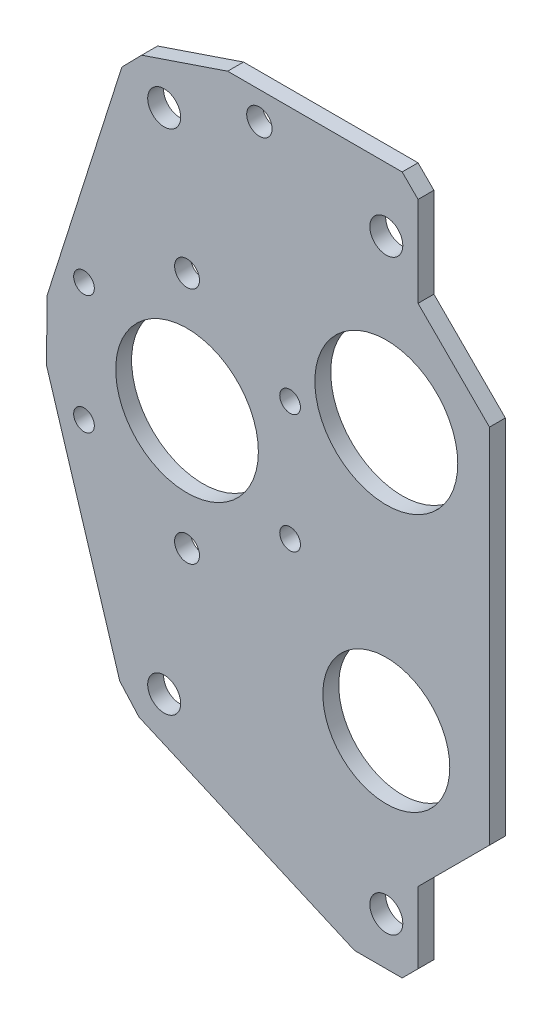
ISO-10303-21;
HEADER;
FILE_DESCRIPTION(('STEP AP214'),'2;1');
FILE_NAME('part.step','',(''),(''),'','','');
FILE_SCHEMA(('AUTOMOTIVE_DESIGN { 1 0 10303 214 1 1 1 1 }'));
ENDSEC;
DATA;
#1=APPLICATION_CONTEXT('core data for automotive mechanical design processes');
#2=APPLICATION_PROTOCOL_DEFINITION('international standard','automotive_design',2000,#1);
#3=PRODUCT_CONTEXT('',#1,'mechanical');
#4=PRODUCT('Part','Part','',(#3));
#5=PRODUCT_RELATED_PRODUCT_CATEGORY('part','',(#4));
#6=PRODUCT_DEFINITION_FORMATION('','',#4);
#7=PRODUCT_DEFINITION_CONTEXT('part definition',#1,'design');
#8=PRODUCT_DEFINITION('design','',#6,#7);
#9=PRODUCT_DEFINITION_SHAPE('','',#8);
#10=(LENGTH_UNIT() NAMED_UNIT(*) SI_UNIT(.MILLI.,.METRE.));
#11=(NAMED_UNIT(*) PLANE_ANGLE_UNIT() SI_UNIT($,.RADIAN.));
#12=(NAMED_UNIT(*) SI_UNIT($,.STERADIAN.) SOLID_ANGLE_UNIT());
#13=UNCERTAINTY_MEASURE_WITH_UNIT(LENGTH_MEASURE(1.E-05),#10,'distance_accuracy_value','');
#14=(GEOMETRIC_REPRESENTATION_CONTEXT(3) GLOBAL_UNCERTAINTY_ASSIGNED_CONTEXT((#13)) GLOBAL_UNIT_ASSIGNED_CONTEXT((#10,
#11,#12)) REPRESENTATION_CONTEXT('',''));
#15=CARTESIAN_POINT('',(0.,0.,0.));
#16=DIRECTION('',(0.,0.,1.));
#17=DIRECTION('',(1.,0.,0.));
#18=AXIS2_PLACEMENT_3D('',#15,#16,#17);
#19=CARTESIAN_POINT('',(0.,0.,0.));
#20=DIRECTION('',(0.,0.,1.));
#21=DIRECTION('',(1.,0.,0.));
#22=AXIS2_PLACEMENT_3D('',#19,#20,#21);
#23=PLANE('',#22);
#24=DIRECTION('',(-0.947188076798087,-0.32067857298476,0.));
#25=VECTOR('',#24,1.);
#26=CARTESIAN_POINT('',(-33.1609002039906,97.9473277455423,0.));
#27=LINE('',#26,#25);
#28=CARTESIAN_POINT('',(-48.9538078594664,92.6005046443076,0.));
#29=VERTEX_POINT('',#28);
#30=CARTESIAN_POINT('',(-31.75,98.425,0.));
#31=VERTEX_POINT('',#30);
#32=EDGE_CURVE('E661',#29,#31,#27,.F.);
#33=ORIENTED_EDGE('',*,*,#32,.F.);
#34=DIRECTION('',(0.7004757379388,0.713676215492077,0.));
#35=VECTOR('',#34,1.);
#36=CARTESIAN_POINT('',(-48.9538078594664,92.6005046443076,0.));
#37=LINE('',#36,#35);
#38=CARTESIAN_POINT('',(-52.9229679271194,88.5565456856429,0.));
#39=VERTEX_POINT('',#38);
#40=EDGE_CURVE('E653',#29,#39,#37,.F.);
#41=ORIENTED_EDGE('',*,*,#40,.T.);
#42=DIRECTION('',(-0.302941078368201,-0.953009288011985,0.));
#43=VECTOR('',#42,1.);
#44=CARTESIAN_POINT('',(-73.6328287693253,23.4062866241446,0.));
#45=LINE('',#44,#43);
#46=CARTESIAN_POINT('',(-67.9263241523619,41.3581336676134,0.));
#47=VERTEX_POINT('',#46);
#48=EDGE_CURVE('E651',#47,#39,#45,.F.);
#49=ORIENTED_EDGE('',*,*,#48,.F.);
#50=DIRECTION('',(0.00396394921512312,0.999992143522448,0.));
#51=VECTOR('',#50,1.);
#52=CARTESIAN_POINT('',(-67.9263241523619,41.3581336676133,0.));
#53=LINE('',#52,#51);
#54=CARTESIAN_POINT('',(-67.9743607697863,29.2398552995184,0.));
#55=VERTEX_POINT('',#54);
#56=EDGE_CURVE('E644',#47,#55,#53,.F.);
#57=ORIENTED_EDGE('',*,*,#56,.T.);
#58=DIRECTION('',(0.295376256726555,-0.955381006176179,0.));
#59=VECTOR('',#58,1.);
#60=CARTESIAN_POINT('',(-53.7923971636767,-16.6310579882147,0.));
#61=LINE('',#60,#59);
#62=CARTESIAN_POINT('',(-53.3456573135953,-18.0760176210564,0.));
#63=VERTEX_POINT('',#62);
#64=EDGE_CURVE('E145',#63,#55,#61,.F.);
#65=ORIENTED_EDGE('',*,*,#64,.F.);
#66=DIRECTION('',(-0.666107578502949,0.745855678976126,0.));
#67=VECTOR('',#66,1.);
#68=CARTESIAN_POINT('',(-53.3456573135953,-18.0760176210564,0.));
#69=LINE('',#68,#67);
#70=CARTESIAN_POINT('',(-49.4993940732019,-22.3827653195768,0.));
#71=VERTEX_POINT('',#70);
#72=EDGE_CURVE('E140',#63,#71,#69,.F.);
#73=ORIENTED_EDGE('',*,*,#72,.T.);
#74=DIRECTION('',(0.916045236310745,-0.401074961861734,0.));
#75=VECTOR('',#74,1.);
#76=CARTESIAN_POINT('',(-16.1860190531105,-36.9684648964657,0.));
#77=LINE('',#76,#75);
#78=CARTESIAN_POINT('',(-6.34999999999987,-41.275,0.));
#79=VERTEX_POINT('',#78);
#80=EDGE_CURVE('E131',#79,#71,#77,.F.);
#81=ORIENTED_EDGE('',*,*,#80,.F.);
#82=DIRECTION('',(1.,0.,0.));
#83=VECTOR('',#82,1.);
#84=CARTESIAN_POINT('',(-76.2,-41.275,0.));
#85=LINE('',#84,#83);
#86=CARTESIAN_POINT('',(3.17499999999999,-41.275,0.));
#87=VERTEX_POINT('',#86);
#88=EDGE_CURVE('E126',#87,#79,#85,.F.);
#89=ORIENTED_EDGE('',*,*,#88,.F.);
#90=DIRECTION('',(0.707106781186547,0.707106781186548,0.));
#91=VECTOR('',#90,1.);
#92=CARTESIAN_POINT('',(6.35,-38.1,0.));
#93=LINE('',#92,#91);
#94=CARTESIAN_POINT('',(6.35,-38.1,0.));
#95=VERTEX_POINT('',#94);
#96=EDGE_CURVE('E698',#95,#87,#93,.F.);
#97=ORIENTED_EDGE('',*,*,#96,.F.);
#98=DIRECTION('',(0.,-1.,0.));
#99=VECTOR('',#98,1.);
#100=CARTESIAN_POINT('',(6.35000000000001,-23.8252,0.));
#101=LINE('',#100,#99);
#102=CARTESIAN_POINT('',(6.35,-23.8252,0.));
#103=VERTEX_POINT('',#102);
#104=EDGE_CURVE('E692',#95,#103,#101,.F.);
#105=ORIENTED_EDGE('',*,*,#104,.T.);
#106=DIRECTION('',(-0.707106781186549,-0.707106781186546,0.));
#107=VECTOR('',#106,1.);
#108=CARTESIAN_POINT('',(20.6502,-9.525,0.));
#109=LINE('',#108,#107);
#110=CARTESIAN_POINT('',(20.6502,-9.52500000000001,0.));
#111=VERTEX_POINT('',#110);
#112=EDGE_CURVE('E687',#103,#111,#109,.F.);
#113=ORIENTED_EDGE('',*,*,#112,.T.);
#114=DIRECTION('',(0.,-1.,0.));
#115=VECTOR('',#114,1.);
#116=CARTESIAN_POINT('',(20.6502,62.9412,0.));
#117=LINE('',#116,#115);
#118=CARTESIAN_POINT('',(20.6502,62.9412,0.));
#119=VERTEX_POINT('',#118);
#120=EDGE_CURVE('E682',#111,#119,#117,.F.);
#121=ORIENTED_EDGE('',*,*,#120,.T.);
#122=DIRECTION('',(0.707106781186549,-0.707106781186546,0.));
#123=VECTOR('',#122,1.);
#124=CARTESIAN_POINT('',(6.35000000000002,77.2414,0.));
#125=LINE('',#124,#123);
#126=CARTESIAN_POINT('',(6.35000000000002,77.2414,0.));
#127=VERTEX_POINT('',#126);
#128=EDGE_CURVE('E677',#119,#127,#125,.F.);
#129=ORIENTED_EDGE('',*,*,#128,.T.);
#130=DIRECTION('',(0.,-1.,0.));
#131=VECTOR('',#130,1.);
#132=CARTESIAN_POINT('',(6.35000000000002,98.425,0.));
#133=LINE('',#132,#131);
#134=CARTESIAN_POINT('',(6.35000000000002,95.25,0.));
#135=VERTEX_POINT('',#134);
#136=EDGE_CURVE('E671',#127,#135,#133,.F.);
#137=ORIENTED_EDGE('',*,*,#136,.T.);
#138=DIRECTION('',(-0.707106781186547,0.707106781186548,0.));
#139=VECTOR('',#138,1.);
#140=CARTESIAN_POINT('',(3.17500000000003,98.425,0.));
#141=LINE('',#140,#139);
#142=CARTESIAN_POINT('',(3.17500000000003,98.425,0.));
#143=VERTEX_POINT('',#142);
#144=EDGE_CURVE('E669',#143,#135,#141,.F.);
#145=ORIENTED_EDGE('',*,*,#144,.F.);
#146=DIRECTION('',(1.,0.,0.));
#147=VECTOR('',#146,1.);
#148=CARTESIAN_POINT('',(-76.2,98.425,0.));
#149=LINE('',#148,#147);
#150=EDGE_CURVE('E665',#31,#143,#149,.T.);
#151=ORIENTED_EDGE('',*,*,#150,.F.);
#152=EDGE_LOOP('',(#33,#41,#49,#57,#65,#73,#81,#89,#97,#105,#113,#121,#129,#137,#145,#151));
#153=FACE_BOUND('',#152,.T.);
#154=CARTESIAN_POINT('',(0.,-31.75,0.));
#155=DIRECTION('',(0.,0.,1.));
#156=DIRECTION('',(1.,0.,0.));
#157=AXIS2_PLACEMENT_3D('',#154,#155,#156);
#158=CIRCLE('',#157,3.302);
#159=CARTESIAN_POINT('',(3.30199999999998,-31.75,0.));
#160=VERTEX_POINT('',#159);
#161=EDGE_CURVE('E149',#160,#160,#158,.F.);
#162=ORIENTED_EDGE('',*,*,#161,.T.);
#163=EDGE_LOOP('',(#162));
#164=FACE_BOUND('',#163,.T.);
#165=CARTESIAN_POINT('',(0.,85.725,0.));
#166=DIRECTION('',(0.,0.,1.));
#167=DIRECTION('',(1.,0.,0.));
#168=AXIS2_PLACEMENT_3D('',#165,#166,#167);
#169=CIRCLE('',#168,3.30199999999999);
#170=CARTESIAN_POINT('',(3.30199999999996,85.725,0.));
#171=VERTEX_POINT('',#170);
#172=EDGE_CURVE('E203',#171,#171,#169,.F.);
#173=ORIENTED_EDGE('',*,*,#172,.T.);
#174=EDGE_LOOP('',(#173));
#175=FACE_BOUND('',#174,.T.);
#176=CARTESIAN_POINT('',(-25.4,92.8624,0.));
#177=DIRECTION('',(0.,0.,1.));
#178=DIRECTION('',(1.,0.,0.));
#179=AXIS2_PLACEMENT_3D('',#176,#177,#178);
#180=CIRCLE('',#179,2.54);
#181=CARTESIAN_POINT('',(-22.86,92.8624,0.));
#182=VERTEX_POINT('',#181);
#183=EDGE_CURVE('E206',#182,#182,#180,.F.);
#184=ORIENTED_EDGE('',*,*,#183,.T.);
#185=EDGE_LOOP('',(#184));
#186=FACE_BOUND('',#185,.T.);
#187=CARTESIAN_POINT('',(0.,53.4162,0.));
#188=DIRECTION('',(0.,0.,1.));
#189=DIRECTION('',(1.,0.,0.));
#190=AXIS2_PLACEMENT_3D('',#187,#188,#189);
#191=CIRCLE('',#190,14.3002);
#192=CARTESIAN_POINT('',(14.3002,53.4162,0.));
#193=VERTEX_POINT('',#192);
#194=EDGE_CURVE('E209',#193,#193,#191,.F.);
#195=ORIENTED_EDGE('',*,*,#194,.T.);
#196=EDGE_LOOP('',(#195));
#197=FACE_BOUND('',#196,.T.);
#198=CARTESIAN_POINT('',(-39.878,35.5392112804997,0.));
#199=DIRECTION('',(0.,0.,1.));
#200=DIRECTION('',(1.,0.,0.));
#201=AXIS2_PLACEMENT_3D('',#198,#199,#200);
#202=CIRCLE('',#201,14.2748);
#203=CARTESIAN_POINT('',(-25.6032,35.5392112804997,0.));
#204=VERTEX_POINT('',#203);
#205=EDGE_CURVE('E212',#204,#204,#202,.F.);
#206=ORIENTED_EDGE('',*,*,#205,.T.);
#207=EDGE_LOOP('',(#206));
#208=FACE_BOUND('',#207,.T.);
#209=CARTESIAN_POINT('',(0.,0.,0.));
#210=DIRECTION('',(0.,0.,1.));
#211=DIRECTION('',(1.,0.,0.));
#212=AXIS2_PLACEMENT_3D('',#209,#210,#211);
#213=CIRCLE('',#212,12.7);
#214=CARTESIAN_POINT('',(12.7,0.,0.));
#215=VERTEX_POINT('',#214);
#216=EDGE_CURVE('E215',#215,#215,#213,.F.);
#217=ORIENTED_EDGE('',*,*,#216,.T.);
#218=EDGE_LOOP('',(#217));
#219=FACE_BOUND('',#218,.T.);
#220=CARTESIAN_POINT('',(-44.45,-15.875,0.));
#221=DIRECTION('',(0.,0.,1.));
#222=DIRECTION('',(1.,0.,0.));
#223=AXIS2_PLACEMENT_3D('',#220,#221,#222);
#224=CIRCLE('',#223,3.302);
#225=CARTESIAN_POINT('',(-41.148,-15.875,0.));
#226=VERTEX_POINT('',#225);
#227=EDGE_CURVE('E218',#226,#226,#224,.F.);
#228=ORIENTED_EDGE('',*,*,#227,.T.);
#229=EDGE_LOOP('',(#228));
#230=FACE_BOUND('',#229,.T.);
#231=CARTESIAN_POINT('',(-44.45,85.725,0.));
#232=DIRECTION('',(0.,0.,1.));
#233=DIRECTION('',(1.,0.,0.));
#234=AXIS2_PLACEMENT_3D('',#231,#232,#233);
#235=CIRCLE('',#234,3.302);
#236=CARTESIAN_POINT('',(-41.148,85.725,0.));
#237=VERTEX_POINT('',#236);
#238=EDGE_CURVE('E221',#237,#237,#235,.F.);
#239=ORIENTED_EDGE('',*,*,#238,.T.);
#240=EDGE_LOOP('',(#239));
#241=FACE_BOUND('',#240,.T.);
#242=CARTESIAN_POINT('',(-39.878,11.6632112804997,0.));
#243=DIRECTION('',(0.,0.,-1.));
#244=DIRECTION('',(-1.,0.,0.));
#245=AXIS2_PLACEMENT_3D('',#242,#243,#244);
#246=CIRCLE('',#245,2.4892);
#247=CARTESIAN_POINT('',(-42.3672,11.6632112804997,0.));
#248=VERTEX_POINT('',#247);
#249=EDGE_CURVE('E224',#248,#248,#246,.T.);
#250=ORIENTED_EDGE('',*,*,#249,.T.);
#251=EDGE_LOOP('',(#250));
#252=FACE_BOUND('',#251,.T.);
#253=CARTESIAN_POINT('',(-19.2557700723829,23.6329612804999,0.));
#254=DIRECTION('',(0.,0.,-1.));
#255=DIRECTION('',(-1.,0.,0.));
#256=AXIS2_PLACEMENT_3D('',#253,#254,#255);
#257=CIRCLE('',#256,2.0701);
#258=CARTESIAN_POINT('',(-21.3258700723829,23.6329612804999,0.));
#259=VERTEX_POINT('',#258);
#260=EDGE_CURVE('E227',#259,#259,#257,.T.);
#261=ORIENTED_EDGE('',*,*,#260,.T.);
#262=EDGE_LOOP('',(#261));
#263=FACE_BOUND('',#262,.T.);
#264=CARTESIAN_POINT('',(-19.2557700723831,47.4454612804998,0.));
#265=DIRECTION('',(0.,0.,-1.));
#266=DIRECTION('',(-1.,0.,0.));
#267=AXIS2_PLACEMENT_3D('',#264,#265,#266);
#268=CIRCLE('',#267,2.07010000000001);
#269=CARTESIAN_POINT('',(-21.3258700723831,47.4454612804998,0.));
#270=VERTEX_POINT('',#269);
#271=EDGE_CURVE('E230',#270,#270,#268,.T.);
#272=ORIENTED_EDGE('',*,*,#271,.T.);
#273=EDGE_LOOP('',(#272));
#274=FACE_BOUND('',#273,.T.);
#275=CARTESIAN_POINT('',(-39.878,59.3517112804997,0.));
#276=DIRECTION('',(0.,0.,-1.));
#277=DIRECTION('',(-1.,0.,0.));
#278=AXIS2_PLACEMENT_3D('',#275,#276,#277);
#279=CIRCLE('',#278,2.4892);
#280=CARTESIAN_POINT('',(-42.3672,59.3517112804997,0.));
#281=VERTEX_POINT('',#280);
#282=EDGE_CURVE('E233',#281,#281,#279,.T.);
#283=ORIENTED_EDGE('',*,*,#282,.T.);
#284=EDGE_LOOP('',(#283));
#285=FACE_BOUND('',#284,.T.);
#286=CARTESIAN_POINT('',(-60.5002299276169,23.6329612804997,0.));
#287=DIRECTION('',(0.,0.,-1.));
#288=DIRECTION('',(-1.,0.,0.));
#289=AXIS2_PLACEMENT_3D('',#286,#287,#288);
#290=CIRCLE('',#289,2.07010000000001);
#291=CARTESIAN_POINT('',(-62.5703299276169,23.6329612804997,0.));
#292=VERTEX_POINT('',#291);
#293=EDGE_CURVE('E235',#292,#292,#290,.T.);
#294=ORIENTED_EDGE('',*,*,#293,.T.);
#295=EDGE_LOOP('',(#294));
#296=FACE_BOUND('',#295,.T.);
#297=CARTESIAN_POINT('',(-60.5002299276171,47.4454612804996,0.));
#298=DIRECTION('',(0.,0.,-1.));
#299=DIRECTION('',(-1.,0.,0.));
#300=AXIS2_PLACEMENT_3D('',#297,#298,#299);
#301=CIRCLE('',#300,2.07010000000001);
#302=CARTESIAN_POINT('',(-62.5703299276171,47.4454612804996,0.));
#303=VERTEX_POINT('',#302);
#304=EDGE_CURVE('E20',#303,#303,#301,.T.);
#305=ORIENTED_EDGE('',*,*,#304,.T.);
#306=EDGE_LOOP('',(#305));
#307=FACE_BOUND('',#306,.T.);
#308=ADVANCED_FACE('F17',(#153,#164,#175,#186,#197,#208,#219,#230,#241,#252,#263,#274,#285,#296,
#307),#23,.T.);
#309=CARTESIAN_POINT('',(-60.5002299276171,47.4454612804996,0.));
#310=DIRECTION('',(0.,0.,-1.));
#311=DIRECTION('',(-1.,0.,0.));
#312=AXIS2_PLACEMENT_3D('',#309,#310,#311);
#313=CYLINDRICAL_SURFACE('',#312,2.07010000000001);
#314=ORIENTED_EDGE('',*,*,#304,.F.);
#315=EDGE_LOOP('',(#314));
#316=FACE_BOUND('',#315,.T.);
#317=CARTESIAN_POINT('',(-60.5002299276171,47.4454612804996,-3.175));
#318=DIRECTION('',(0.,0.,-1.));
#319=DIRECTION('',(-1.,0.,0.));
#320=AXIS2_PLACEMENT_3D('',#317,#318,#319);
#321=CIRCLE('',#320,2.07010000000001);
#322=CARTESIAN_POINT('',(-62.5703299276171,47.4454612804996,-3.175));
#323=VERTEX_POINT('',#322);
#324=EDGE_CURVE('E197',#323,#323,#321,.T.);
#325=ORIENTED_EDGE('',*,*,#324,.T.);
#326=EDGE_LOOP('',(#325));
#327=FACE_BOUND('',#326,.T.);
#328=ADVANCED_FACE('F243',(#316,#327),#313,.F.);
#329=CARTESIAN_POINT('',(-60.5002299276169,23.6329612804997,0.));
#330=DIRECTION('',(0.,0.,-1.));
#331=DIRECTION('',(-1.,0.,0.));
#332=AXIS2_PLACEMENT_3D('',#329,#330,#331);
#333=CYLINDRICAL_SURFACE('',#332,2.07010000000001);
#334=ORIENTED_EDGE('',*,*,#293,.F.);
#335=EDGE_LOOP('',(#334));
#336=FACE_BOUND('',#335,.T.);
#337=CARTESIAN_POINT('',(-60.5002299276169,23.6329612804997,-3.175));
#338=DIRECTION('',(0.,0.,-1.));
#339=DIRECTION('',(-1.,0.,0.));
#340=AXIS2_PLACEMENT_3D('',#337,#338,#339);
#341=CIRCLE('',#340,2.07010000000001);
#342=CARTESIAN_POINT('',(-62.5703299276169,23.6329612804997,-3.175));
#343=VERTEX_POINT('',#342);
#344=EDGE_CURVE('E194',#343,#343,#341,.T.);
#345=ORIENTED_EDGE('',*,*,#344,.T.);
#346=EDGE_LOOP('',(#345));
#347=FACE_BOUND('',#346,.T.);
#348=ADVANCED_FACE('F246',(#336,#347),#333,.F.);
#349=CARTESIAN_POINT('',(-39.878,59.3517112804997,0.));
#350=DIRECTION('',(0.,0.,-1.));
#351=DIRECTION('',(-1.,0.,0.));
#352=AXIS2_PLACEMENT_3D('',#349,#350,#351);
#353=CYLINDRICAL_SURFACE('',#352,2.4892);
#354=ORIENTED_EDGE('',*,*,#282,.F.);
#355=EDGE_LOOP('',(#354));
#356=FACE_BOUND('',#355,.T.);
#357=CARTESIAN_POINT('',(-39.878,59.3517112804997,-3.175));
#358=DIRECTION('',(0.,0.,-1.));
#359=DIRECTION('',(-1.,0.,0.));
#360=AXIS2_PLACEMENT_3D('',#357,#358,#359);
#361=CIRCLE('',#360,2.4892);
#362=CARTESIAN_POINT('',(-42.3672,59.3517112804997,-3.175));
#363=VERTEX_POINT('',#362);
#364=EDGE_CURVE('E191',#363,#363,#361,.T.);
#365=ORIENTED_EDGE('',*,*,#364,.T.);
#366=EDGE_LOOP('',(#365));
#367=FACE_BOUND('',#366,.T.);
#368=ADVANCED_FACE('F360',(#356,#367),#353,.F.);
#369=CARTESIAN_POINT('',(-19.2557700723831,47.4454612804998,0.));
#370=DIRECTION('',(0.,0.,-1.));
#371=DIRECTION('',(-1.,0.,0.));
#372=AXIS2_PLACEMENT_3D('',#369,#370,#371);
#373=CYLINDRICAL_SURFACE('',#372,2.07010000000001);
#374=ORIENTED_EDGE('',*,*,#271,.F.);
#375=EDGE_LOOP('',(#374));
#376=FACE_BOUND('',#375,.T.);
#377=CARTESIAN_POINT('',(-19.2557700723831,47.4454612804998,-3.175));
#378=DIRECTION('',(0.,0.,-1.));
#379=DIRECTION('',(-1.,0.,0.));
#380=AXIS2_PLACEMENT_3D('',#377,#378,#379);
#381=CIRCLE('',#380,2.07010000000001);
#382=CARTESIAN_POINT('',(-21.3258700723831,47.4454612804998,-3.175));
#383=VERTEX_POINT('',#382);
#384=EDGE_CURVE('E188',#383,#383,#381,.T.);
#385=ORIENTED_EDGE('',*,*,#384,.T.);
#386=EDGE_LOOP('',(#385));
#387=FACE_BOUND('',#386,.T.);
#388=ADVANCED_FACE('F356',(#376,#387),#373,.F.);
#389=CARTESIAN_POINT('',(-19.2557700723829,23.6329612804999,0.));
#390=DIRECTION('',(0.,0.,-1.));
#391=DIRECTION('',(-1.,0.,0.));
#392=AXIS2_PLACEMENT_3D('',#389,#390,#391);
#393=CYLINDRICAL_SURFACE('',#392,2.0701);
#394=ORIENTED_EDGE('',*,*,#260,.F.);
#395=EDGE_LOOP('',(#394));
#396=FACE_BOUND('',#395,.T.);
#397=CARTESIAN_POINT('',(-19.2557700723829,23.6329612804999,-3.175));
#398=DIRECTION('',(0.,0.,-1.));
#399=DIRECTION('',(-1.,0.,0.));
#400=AXIS2_PLACEMENT_3D('',#397,#398,#399);
#401=CIRCLE('',#400,2.0701);
#402=CARTESIAN_POINT('',(-21.3258700723829,23.6329612804999,-3.175));
#403=VERTEX_POINT('',#402);
#404=EDGE_CURVE('E185',#403,#403,#401,.T.);
#405=ORIENTED_EDGE('',*,*,#404,.T.);
#406=EDGE_LOOP('',(#405));
#407=FACE_BOUND('',#406,.T.);
#408=ADVANCED_FACE('F352',(#396,#407),#393,.F.);
#409=CARTESIAN_POINT('',(-39.878,11.6632112804997,0.));
#410=DIRECTION('',(0.,0.,-1.));
#411=DIRECTION('',(-1.,0.,0.));
#412=AXIS2_PLACEMENT_3D('',#409,#410,#411);
#413=CYLINDRICAL_SURFACE('',#412,2.4892);
#414=ORIENTED_EDGE('',*,*,#249,.F.);
#415=EDGE_LOOP('',(#414));
#416=FACE_BOUND('',#415,.T.);
#417=CARTESIAN_POINT('',(-39.878,11.6632112804997,-3.175));
#418=DIRECTION('',(0.,0.,-1.));
#419=DIRECTION('',(-1.,0.,0.));
#420=AXIS2_PLACEMENT_3D('',#417,#418,#419);
#421=CIRCLE('',#420,2.4892);
#422=CARTESIAN_POINT('',(-42.3672,11.6632112804997,-3.175));
#423=VERTEX_POINT('',#422);
#424=EDGE_CURVE('E182',#423,#423,#421,.T.);
#425=ORIENTED_EDGE('',*,*,#424,.T.);
#426=EDGE_LOOP('',(#425));
#427=FACE_BOUND('',#426,.T.);
#428=ADVANCED_FACE('F348',(#416,#427),#413,.F.);
#429=CARTESIAN_POINT('',(-44.45,85.725,-3.175));
#430=DIRECTION('',(0.,0.,1.));
#431=DIRECTION('',(1.,0.,0.));
#432=AXIS2_PLACEMENT_3D('',#429,#430,#431);
#433=CYLINDRICAL_SURFACE('',#432,3.302);
#434=CARTESIAN_POINT('',(-44.45,85.725,-3.175));
#435=DIRECTION('',(0.,0.,1.));
#436=DIRECTION('',(1.,0.,0.));
#437=AXIS2_PLACEMENT_3D('',#434,#435,#436);
#438=CIRCLE('',#437,3.302);
#439=CARTESIAN_POINT('',(-41.148,85.725,-3.175));
#440=VERTEX_POINT('',#439);
#441=EDGE_CURVE('E179',#440,#440,#438,.F.);
#442=ORIENTED_EDGE('',*,*,#441,.T.);
#443=EDGE_LOOP('',(#442));
#444=FACE_BOUND('',#443,.T.);
#445=ORIENTED_EDGE('',*,*,#238,.F.);
#446=EDGE_LOOP('',(#445));
#447=FACE_BOUND('',#446,.T.);
#448=ADVANCED_FACE('F344',(#444,#447),#433,.F.);
#449=CARTESIAN_POINT('',(-44.45,-15.875,-3.175));
#450=DIRECTION('',(0.,0.,1.));
#451=DIRECTION('',(1.,0.,0.));
#452=AXIS2_PLACEMENT_3D('',#449,#450,#451);
#453=CYLINDRICAL_SURFACE('',#452,3.302);
#454=CARTESIAN_POINT('',(-44.45,-15.875,-3.175));
#455=DIRECTION('',(0.,0.,1.));
#456=DIRECTION('',(1.,0.,0.));
#457=AXIS2_PLACEMENT_3D('',#454,#455,#456);
#458=CIRCLE('',#457,3.302);
#459=CARTESIAN_POINT('',(-41.148,-15.875,-3.175));
#460=VERTEX_POINT('',#459);
#461=EDGE_CURVE('E176',#460,#460,#458,.F.);
#462=ORIENTED_EDGE('',*,*,#461,.T.);
#463=EDGE_LOOP('',(#462));
#464=FACE_BOUND('',#463,.T.);
#465=ORIENTED_EDGE('',*,*,#227,.F.);
#466=EDGE_LOOP('',(#465));
#467=FACE_BOUND('',#466,.T.);
#468=ADVANCED_FACE('F340',(#464,#467),#453,.F.);
#469=CARTESIAN_POINT('',(0.,0.,-3.175));
#470=DIRECTION('',(0.,0.,1.));
#471=DIRECTION('',(1.,0.,0.));
#472=AXIS2_PLACEMENT_3D('',#469,#470,#471);
#473=CYLINDRICAL_SURFACE('',#472,12.7);
#474=CARTESIAN_POINT('',(0.,0.,-3.175));
#475=DIRECTION('',(0.,0.,1.));
#476=DIRECTION('',(1.,0.,0.));
#477=AXIS2_PLACEMENT_3D('',#474,#475,#476);
#478=CIRCLE('',#477,12.7);
#479=CARTESIAN_POINT('',(12.7,0.,-3.175));
#480=VERTEX_POINT('',#479);
#481=EDGE_CURVE('E173',#480,#480,#478,.F.);
#482=ORIENTED_EDGE('',*,*,#481,.T.);
#483=EDGE_LOOP('',(#482));
#484=FACE_BOUND('',#483,.T.);
#485=ORIENTED_EDGE('',*,*,#216,.F.);
#486=EDGE_LOOP('',(#485));
#487=FACE_BOUND('',#486,.T.);
#488=ADVANCED_FACE('F336',(#484,#487),#473,.F.);
#489=CARTESIAN_POINT('',(-39.878,35.5392112804997,-3.175));
#490=DIRECTION('',(0.,0.,1.));
#491=DIRECTION('',(1.,0.,0.));
#492=AXIS2_PLACEMENT_3D('',#489,#490,#491);
#493=CYLINDRICAL_SURFACE('',#492,14.2748);
#494=CARTESIAN_POINT('',(-39.878,35.5392112804997,-3.175));
#495=DIRECTION('',(0.,0.,1.));
#496=DIRECTION('',(1.,0.,0.));
#497=AXIS2_PLACEMENT_3D('',#494,#495,#496);
#498=CIRCLE('',#497,14.2748);
#499=CARTESIAN_POINT('',(-25.6032,35.5392112804997,-3.175));
#500=VERTEX_POINT('',#499);
#501=EDGE_CURVE('E170',#500,#500,#498,.F.);
#502=ORIENTED_EDGE('',*,*,#501,.T.);
#503=EDGE_LOOP('',(#502));
#504=FACE_BOUND('',#503,.T.);
#505=ORIENTED_EDGE('',*,*,#205,.F.);
#506=EDGE_LOOP('',(#505));
#507=FACE_BOUND('',#506,.T.);
#508=ADVANCED_FACE('F332',(#504,#507),#493,.F.);
#509=CARTESIAN_POINT('',(0.,53.4162,-3.175));
#510=DIRECTION('',(0.,0.,1.));
#511=DIRECTION('',(1.,0.,0.));
#512=AXIS2_PLACEMENT_3D('',#509,#510,#511);
#513=CYLINDRICAL_SURFACE('',#512,14.3002);
#514=CARTESIAN_POINT('',(0.,53.4162,-3.175));
#515=DIRECTION('',(0.,0.,1.));
#516=DIRECTION('',(1.,0.,0.));
#517=AXIS2_PLACEMENT_3D('',#514,#515,#516);
#518=CIRCLE('',#517,14.3002);
#519=CARTESIAN_POINT('',(14.3002,53.4162,-3.175));
#520=VERTEX_POINT('',#519);
#521=EDGE_CURVE('E167',#520,#520,#518,.F.);
#522=ORIENTED_EDGE('',*,*,#521,.T.);
#523=EDGE_LOOP('',(#522));
#524=FACE_BOUND('',#523,.T.);
#525=ORIENTED_EDGE('',*,*,#194,.F.);
#526=EDGE_LOOP('',(#525));
#527=FACE_BOUND('',#526,.T.);
#528=ADVANCED_FACE('F328',(#524,#527),#513,.F.);
#529=CARTESIAN_POINT('',(-25.4,92.8624,-3.175));
#530=DIRECTION('',(0.,0.,1.));
#531=DIRECTION('',(1.,0.,0.));
#532=AXIS2_PLACEMENT_3D('',#529,#530,#531);
#533=CYLINDRICAL_SURFACE('',#532,2.54);
#534=CARTESIAN_POINT('',(-25.4,92.8624,-3.175));
#535=DIRECTION('',(0.,0.,1.));
#536=DIRECTION('',(1.,0.,0.));
#537=AXIS2_PLACEMENT_3D('',#534,#535,#536);
#538=CIRCLE('',#537,2.54);
#539=CARTESIAN_POINT('',(-22.86,92.8624,-3.175));
#540=VERTEX_POINT('',#539);
#541=EDGE_CURVE('E164',#540,#540,#538,.F.);
#542=ORIENTED_EDGE('',*,*,#541,.T.);
#543=EDGE_LOOP('',(#542));
#544=FACE_BOUND('',#543,.T.);
#545=ORIENTED_EDGE('',*,*,#183,.F.);
#546=EDGE_LOOP('',(#545));
#547=FACE_BOUND('',#546,.T.);
#548=ADVANCED_FACE('F324',(#544,#547),#533,.F.);
#549=CARTESIAN_POINT('',(0.,85.725,-3.175));
#550=DIRECTION('',(0.,0.,1.));
#551=DIRECTION('',(1.,0.,0.));
#552=AXIS2_PLACEMENT_3D('',#549,#550,#551);
#553=CYLINDRICAL_SURFACE('',#552,3.30199999999999);
#554=CARTESIAN_POINT('',(0.,85.725,-3.175));
#555=DIRECTION('',(0.,0.,1.));
#556=DIRECTION('',(1.,0.,0.));
#557=AXIS2_PLACEMENT_3D('',#554,#555,#556);
#558=CIRCLE('',#557,3.30199999999999);
#559=CARTESIAN_POINT('',(3.30199999999996,85.725,-3.175));
#560=VERTEX_POINT('',#559);
#561=EDGE_CURVE('E161',#560,#560,#558,.F.);
#562=ORIENTED_EDGE('',*,*,#561,.T.);
#563=EDGE_LOOP('',(#562));
#564=FACE_BOUND('',#563,.T.);
#565=ORIENTED_EDGE('',*,*,#172,.F.);
#566=EDGE_LOOP('',(#565));
#567=FACE_BOUND('',#566,.T.);
#568=ADVANCED_FACE('F320',(#564,#567),#553,.F.);
#569=CARTESIAN_POINT('',(0.,-31.75,-3.175));
#570=DIRECTION('',(0.,0.,1.));
#571=DIRECTION('',(1.,0.,0.));
#572=AXIS2_PLACEMENT_3D('',#569,#570,#571);
#573=CYLINDRICAL_SURFACE('',#572,3.302);
#574=CARTESIAN_POINT('',(0.,-31.75,-3.175));
#575=DIRECTION('',(0.,0.,1.));
#576=DIRECTION('',(1.,0.,0.));
#577=AXIS2_PLACEMENT_3D('',#574,#575,#576);
#578=CIRCLE('',#577,3.302);
#579=CARTESIAN_POINT('',(3.30199999999998,-31.75,-3.175));
#580=VERTEX_POINT('',#579);
#581=EDGE_CURVE('E158',#580,#580,#578,.F.);
#582=ORIENTED_EDGE('',*,*,#581,.T.);
#583=EDGE_LOOP('',(#582));
#584=FACE_BOUND('',#583,.T.);
#585=ORIENTED_EDGE('',*,*,#161,.F.);
#586=EDGE_LOOP('',(#585));
#587=FACE_BOUND('',#586,.T.);
#588=ADVANCED_FACE('F317',(#584,#587),#573,.F.);
#589=CARTESIAN_POINT('',(-53.3456573135953,-18.0760176210564,-3.175));
#590=DIRECTION('',(0.745855678976126,0.666107578502949,0.));
#591=DIRECTION('',(-0.666107578502949,0.745855678976126,0.));
#592=AXIS2_PLACEMENT_3D('',#589,#590,#591);
#593=PLANE('',#592);
#594=DIRECTION('',(0.,0.,1.));
#595=VECTOR('',#594,1.);
#596=CARTESIAN_POINT('',(-49.4993940732019,-22.3827653195767,-3.175));
#597=LINE('',#596,#595);
#598=CARTESIAN_POINT('',(-49.4993940732019,-22.3827653195768,-3.175));
#599=VERTEX_POINT('',#598);
#600=EDGE_CURVE('E136',#71,#599,#597,.F.);
#601=ORIENTED_EDGE('',*,*,#600,.F.);
#602=ORIENTED_EDGE('',*,*,#72,.F.);
#603=DIRECTION('',(0.,0.,1.));
#604=VECTOR('',#603,1.);
#605=CARTESIAN_POINT('',(-53.3456573135953,-18.0760176210564,-3.175));
#606=LINE('',#605,#604);
#607=CARTESIAN_POINT('',(-53.3456573135953,-18.0760176210564,-3.175));
#608=VERTEX_POINT('',#607);
#609=EDGE_CURVE('E200',#608,#63,#606,.T.);
#610=ORIENTED_EDGE('',*,*,#609,.F.);
#611=DIRECTION('',(0.666107578502949,-0.745855678976125,0.));
#612=VECTOR('',#611,1.);
#613=CARTESIAN_POINT('',(-53.3456573135953,-18.0760176210564,-3.175));
#614=LINE('',#613,#612);
#615=EDGE_CURVE('E153',#608,#599,#614,.T.);
#616=ORIENTED_EDGE('',*,*,#615,.T.);
#617=EDGE_LOOP('',(#601,#602,#610,#616));
#618=FACE_BOUND('',#617,.T.);
#619=ADVANCED_FACE('F152',(#618),#593,.F.);
#620=CARTESIAN_POINT('',(-16.1860190531105,-36.9684648964657,-3.175));
#621=DIRECTION('',(-0.401074961861734,-0.916045236310745,0.));
#622=DIRECTION('',(0.916045236310745,-0.401074961861734,0.));
#623=AXIS2_PLACEMENT_3D('',#620,#621,#622);
#624=PLANE('',#623);
#625=DIRECTION('',(0.916045236310745,-0.401074961861733,0.));
#626=VECTOR('',#625,1.);
#627=CARTESIAN_POINT('',(-49.4993940732018,-22.3827653195768,-3.175));
#628=LINE('',#627,#626);
#629=CARTESIAN_POINT('',(-6.34999999999987,-41.275,-3.175));
#630=VERTEX_POINT('',#629);
#631=EDGE_CURVE('E632',#599,#630,#628,.T.);
#632=ORIENTED_EDGE('',*,*,#631,.T.);
#633=DIRECTION('',(0.,0.,-1.));
#634=VECTOR('',#633,1.);
#635=CARTESIAN_POINT('',(-6.34999999999987,-41.275,-3.175));
#636=LINE('',#635,#634);
#637=EDGE_CURVE('E138',#79,#630,#636,.T.);
#638=ORIENTED_EDGE('',*,*,#637,.F.);
#639=ORIENTED_EDGE('',*,*,#80,.T.);
#640=ORIENTED_EDGE('',*,*,#600,.T.);
#641=EDGE_LOOP('',(#632,#638,#639,#640));
#642=FACE_BOUND('',#641,.T.);
#643=ADVANCED_FACE('F134',(#642),#624,.T.);
#644=CARTESIAN_POINT('',(-76.2,-41.275,-3.175));
#645=DIRECTION('',(0.,-1.,0.));
#646=DIRECTION('',(0.,0.,-1.));
#647=AXIS2_PLACEMENT_3D('',#644,#645,#646);
#648=PLANE('',#647);
#649=DIRECTION('',(1.,0.,0.));
#650=VECTOR('',#649,1.);
#651=CARTESIAN_POINT('',(0.,-41.275,-3.175));
#652=LINE('',#651,#650);
#653=CARTESIAN_POINT('',(3.17499999999999,-41.275,-3.175));
#654=VERTEX_POINT('',#653);
#655=EDGE_CURVE('E628',#630,#654,#652,.T.);
#656=ORIENTED_EDGE('',*,*,#655,.T.);
#657=DIRECTION('',(0.,0.,1.));
#658=VECTOR('',#657,1.);
#659=CARTESIAN_POINT('',(3.175,-41.275,0.));
#660=LINE('',#659,#658);
#661=EDGE_CURVE('E629',#87,#654,#660,.F.);
#662=ORIENTED_EDGE('',*,*,#661,.F.);
#663=ORIENTED_EDGE('',*,*,#88,.T.);
#664=ORIENTED_EDGE('',*,*,#637,.T.);
#665=EDGE_LOOP('',(#656,#662,#663,#664));
#666=FACE_BOUND('',#665,.T.);
#667=ADVANCED_FACE('F309',(#666),#648,.T.);
#668=CARTESIAN_POINT('',(6.35,-38.1,0.));
#669=DIRECTION('',(0.707106781186548,-0.707106781186547,0.));
#670=DIRECTION('',(0.707106781186547,0.707106781186548,0.));
#671=AXIS2_PLACEMENT_3D('',#668,#669,#670);
#672=PLANE('',#671);
#673=DIRECTION('',(0.70710678118655,0.707106781186545,0.));
#674=VECTOR('',#673,1.);
#675=CARTESIAN_POINT('',(3.17499999999998,-41.275,-3.175));
#676=LINE('',#675,#674);
#677=CARTESIAN_POINT('',(6.35,-38.1,-3.175));
#678=VERTEX_POINT('',#677);
#679=EDGE_CURVE('E631',#654,#678,#676,.T.);
#680=ORIENTED_EDGE('',*,*,#679,.T.);
#681=DIRECTION('',(0.,0.,1.));
#682=VECTOR('',#681,1.);
#683=CARTESIAN_POINT('',(6.35,-38.1,0.));
#684=LINE('',#683,#682);
#685=EDGE_CURVE('E694',#678,#95,#684,.T.);
#686=ORIENTED_EDGE('',*,*,#685,.T.);
#687=ORIENTED_EDGE('',*,*,#96,.T.);
#688=ORIENTED_EDGE('',*,*,#661,.T.);
#689=EDGE_LOOP('',(#680,#686,#687,#688));
#690=FACE_BOUND('',#689,.T.);
#691=ADVANCED_FACE('F305',(#690),#672,.T.);
#692=CARTESIAN_POINT('',(6.35000000000001,-23.8252,0.));
#693=DIRECTION('',(-1.,0.,0.));
#694=DIRECTION('',(0.,-1.,0.));
#695=AXIS2_PLACEMENT_3D('',#692,#693,#694);
#696=PLANE('',#695);
#697=ORIENTED_EDGE('',*,*,#685,.F.);
#698=DIRECTION('',(0.,1.,0.));
#699=VECTOR('',#698,1.);
#700=CARTESIAN_POINT('',(6.35,0.,-3.175));
#701=LINE('',#700,#699);
#702=CARTESIAN_POINT('',(6.35,-23.8252,-3.175));
#703=VERTEX_POINT('',#702);
#704=EDGE_CURVE('E635',#678,#703,#701,.T.);
#705=ORIENTED_EDGE('',*,*,#704,.T.);
#706=DIRECTION('',(0.,0.,1.));
#707=VECTOR('',#706,1.);
#708=CARTESIAN_POINT('',(6.35,-23.8252,0.));
#709=LINE('',#708,#707);
#710=EDGE_CURVE('E689',#703,#103,#709,.T.);
#711=ORIENTED_EDGE('',*,*,#710,.T.);
#712=ORIENTED_EDGE('',*,*,#104,.F.);
#713=EDGE_LOOP('',(#697,#705,#711,#712));
#714=FACE_BOUND('',#713,.T.);
#715=ADVANCED_FACE('F301',(#714),#696,.F.);
#716=CARTESIAN_POINT('',(20.6502,-9.525,0.));
#717=DIRECTION('',(-0.707106781186546,0.707106781186549,0.));
#718=DIRECTION('',(-0.707106781186549,-0.707106781186546,0.));
#719=AXIS2_PLACEMENT_3D('',#716,#717,#718);
#720=PLANE('',#719);
#721=DIRECTION('',(0.,0.,1.));
#722=VECTOR('',#721,1.);
#723=CARTESIAN_POINT('',(20.6502,-9.52500000000001,0.));
#724=LINE('',#723,#722);
#725=CARTESIAN_POINT('',(20.6502,-9.52500000000001,-3.175));
#726=VERTEX_POINT('',#725);
#727=EDGE_CURVE('E684',#726,#111,#724,.T.);
#728=ORIENTED_EDGE('',*,*,#727,.T.);
#729=ORIENTED_EDGE('',*,*,#112,.F.);
#730=ORIENTED_EDGE('',*,*,#710,.F.);
#731=DIRECTION('',(0.707106781186549,0.707106781186546,0.));
#732=VECTOR('',#731,1.);
#733=CARTESIAN_POINT('',(6.35000000000001,-23.8252,-3.175));
#734=LINE('',#733,#732);
#735=EDGE_CURVE('E705',#703,#726,#734,.T.);
#736=ORIENTED_EDGE('',*,*,#735,.T.);
#737=EDGE_LOOP('',(#728,#729,#730,#736));
#738=FACE_BOUND('',#737,.T.);
#739=ADVANCED_FACE('F297',(#738),#720,.F.);
#740=CARTESIAN_POINT('',(20.6502,62.9412,0.));
#741=DIRECTION('',(-1.,0.,0.));
#742=DIRECTION('',(0.,-1.,0.));
#743=AXIS2_PLACEMENT_3D('',#740,#741,#742);
#744=PLANE('',#743);
#745=DIRECTION('',(0.,0.,1.));
#746=VECTOR('',#745,1.);
#747=CARTESIAN_POINT('',(20.6502,62.9412,0.));
#748=LINE('',#747,#746);
#749=CARTESIAN_POINT('',(20.6502,62.9412,-3.175));
#750=VERTEX_POINT('',#749);
#751=EDGE_CURVE('E679',#750,#119,#748,.T.);
#752=ORIENTED_EDGE('',*,*,#751,.T.);
#753=ORIENTED_EDGE('',*,*,#120,.F.);
#754=ORIENTED_EDGE('',*,*,#727,.F.);
#755=DIRECTION('',(0.,1.,0.));
#756=VECTOR('',#755,1.);
#757=CARTESIAN_POINT('',(20.6502,0.,-3.175));
#758=LINE('',#757,#756);
#759=EDGE_CURVE('E709',#726,#750,#758,.T.);
#760=ORIENTED_EDGE('',*,*,#759,.T.);
#761=EDGE_LOOP('',(#752,#753,#754,#760));
#762=FACE_BOUND('',#761,.T.);
#763=ADVANCED_FACE('F293',(#762),#744,.F.);
#764=CARTESIAN_POINT('',(6.35000000000002,77.2414,0.));
#765=DIRECTION('',(-0.707106781186546,-0.707106781186549,0.));
#766=DIRECTION('',(0.707106781186549,-0.707106781186546,0.));
#767=AXIS2_PLACEMENT_3D('',#764,#765,#766);
#768=PLANE('',#767);
#769=DIRECTION('',(0.,0.,1.));
#770=VECTOR('',#769,1.);
#771=CARTESIAN_POINT('',(6.35000000000001,77.2414,0.));
#772=LINE('',#771,#770);
#773=CARTESIAN_POINT('',(6.35000000000002,77.2414,-3.175));
#774=VERTEX_POINT('',#773);
#775=EDGE_CURVE('E674',#774,#127,#772,.T.);
#776=ORIENTED_EDGE('',*,*,#775,.T.);
#777=ORIENTED_EDGE('',*,*,#128,.F.);
#778=ORIENTED_EDGE('',*,*,#751,.F.);
#779=DIRECTION('',(-0.707106781186549,0.707106781186546,0.));
#780=VECTOR('',#779,1.);
#781=CARTESIAN_POINT('',(20.6502,62.9412,-3.175));
#782=LINE('',#781,#780);
#783=EDGE_CURVE('E711',#750,#774,#782,.T.);
#784=ORIENTED_EDGE('',*,*,#783,.T.);
#785=EDGE_LOOP('',(#776,#777,#778,#784));
#786=FACE_BOUND('',#785,.T.);
#787=ADVANCED_FACE('F289',(#786),#768,.F.);
#788=CARTESIAN_POINT('',(6.35000000000002,98.425,0.));
#789=DIRECTION('',(-1.,0.,0.));
#790=DIRECTION('',(0.,-1.,0.));
#791=AXIS2_PLACEMENT_3D('',#788,#789,#790);
#792=PLANE('',#791);
#793=DIRECTION('',(0.,0.,1.));
#794=VECTOR('',#793,1.);
#795=CARTESIAN_POINT('',(6.35000000000003,95.25,-3.175));
#796=LINE('',#795,#794);
#797=CARTESIAN_POINT('',(6.35000000000002,95.25,-3.175));
#798=VERTEX_POINT('',#797);
#799=EDGE_CURVE('E667',#135,#798,#796,.F.);
#800=ORIENTED_EDGE('',*,*,#799,.F.);
#801=ORIENTED_EDGE('',*,*,#136,.F.);
#802=ORIENTED_EDGE('',*,*,#775,.F.);
#803=DIRECTION('',(0.,1.,0.));
#804=VECTOR('',#803,1.);
#805=CARTESIAN_POINT('',(6.35000000000002,0.,-3.175));
#806=LINE('',#805,#804);
#807=EDGE_CURVE('E716',#774,#798,#806,.T.);
#808=ORIENTED_EDGE('',*,*,#807,.T.);
#809=EDGE_LOOP('',(#800,#801,#802,#808));
#810=FACE_BOUND('',#809,.T.);
#811=ADVANCED_FACE('F285',(#810),#792,.F.);
#812=CARTESIAN_POINT('',(3.17500000000003,98.425,-3.175));
#813=DIRECTION('',(0.707106781186548,0.707106781186547,0.));
#814=DIRECTION('',(-0.707106781186547,0.707106781186548,0.));
#815=AXIS2_PLACEMENT_3D('',#812,#813,#814);
#816=PLANE('',#815);
#817=DIRECTION('',(-0.707106781186547,0.707106781186548,0.));
#818=VECTOR('',#817,1.);
#819=CARTESIAN_POINT('',(6.35000000000002,95.25,-3.175));
#820=LINE('',#819,#818);
#821=CARTESIAN_POINT('',(3.17500000000003,98.425,-3.175));
#822=VERTEX_POINT('',#821);
#823=EDGE_CURVE('E719',#798,#822,#820,.T.);
#824=ORIENTED_EDGE('',*,*,#823,.T.);
#825=DIRECTION('',(0.,0.,1.));
#826=VECTOR('',#825,1.);
#827=CARTESIAN_POINT('',(3.17500000000004,98.425,-3.175));
#828=LINE('',#827,#826);
#829=EDGE_CURVE('E663',#143,#822,#828,.F.);
#830=ORIENTED_EDGE('',*,*,#829,.F.);
#831=ORIENTED_EDGE('',*,*,#144,.T.);
#832=ORIENTED_EDGE('',*,*,#799,.T.);
#833=EDGE_LOOP('',(#824,#830,#831,#832));
#834=FACE_BOUND('',#833,.T.);
#835=ADVANCED_FACE('F281',(#834),#816,.T.);
#836=CARTESIAN_POINT('',(-76.2,98.425,-3.175));
#837=DIRECTION('',(0.,1.,0.));
#838=DIRECTION('',(0.,0.,1.));
#839=AXIS2_PLACEMENT_3D('',#836,#837,#838);
#840=PLANE('',#839);
#841=ORIENTED_EDGE('',*,*,#150,.T.);
#842=ORIENTED_EDGE('',*,*,#829,.T.);
#843=DIRECTION('',(1.,0.,0.));
#844=VECTOR('',#843,1.);
#845=CARTESIAN_POINT('',(0.,98.425,-3.175));
#846=LINE('',#845,#844);
#847=CARTESIAN_POINT('',(-31.75,98.425,-3.175));
#848=VERTEX_POINT('',#847);
#849=EDGE_CURVE('E722',#822,#848,#846,.F.);
#850=ORIENTED_EDGE('',*,*,#849,.T.);
#851=DIRECTION('',(0.,0.,1.));
#852=VECTOR('',#851,1.);
#853=CARTESIAN_POINT('',(-31.7499999999999,98.425,-3.175));
#854=LINE('',#853,#852);
#855=EDGE_CURVE('E659',#31,#848,#854,.F.);
#856=ORIENTED_EDGE('',*,*,#855,.F.);
#857=EDGE_LOOP('',(#841,#842,#850,#856));
#858=FACE_BOUND('',#857,.T.);
#859=ADVANCED_FACE('F277',(#858),#840,.T.);
#860=CARTESIAN_POINT('',(-33.1609002039906,97.9473277455423,-3.175));
#861=DIRECTION('',(-0.32067857298476,0.947188076798087,0.));
#862=DIRECTION('',(-0.947188076798087,-0.32067857298476,0.));
#863=AXIS2_PLACEMENT_3D('',#860,#861,#862);
#864=PLANE('',#863);
#865=ORIENTED_EDGE('',*,*,#32,.T.);
#866=ORIENTED_EDGE('',*,*,#855,.T.);
#867=DIRECTION('',(-0.947188076798087,-0.320678572984759,0.));
#868=VECTOR('',#867,1.);
#869=CARTESIAN_POINT('',(-31.7499999999999,98.425,-3.175));
#870=LINE('',#869,#868);
#871=CARTESIAN_POINT('',(-48.9538078594664,92.6005046443076,-3.175));
#872=VERTEX_POINT('',#871);
#873=EDGE_CURVE('E725',#848,#872,#870,.T.);
#874=ORIENTED_EDGE('',*,*,#873,.T.);
#875=DIRECTION('',(0.,0.,1.));
#876=VECTOR('',#875,1.);
#877=CARTESIAN_POINT('',(-48.9538078594664,92.6005046443076,-3.175));
#878=LINE('',#877,#876);
#879=EDGE_CURVE('E656',#872,#29,#878,.T.);
#880=ORIENTED_EDGE('',*,*,#879,.T.);
#881=EDGE_LOOP('',(#865,#866,#874,#880));
#882=FACE_BOUND('',#881,.T.);
#883=ADVANCED_FACE('F273',(#882),#864,.T.);
#884=CARTESIAN_POINT('',(-48.9538078594664,92.6005046443076,-3.175));
#885=DIRECTION('',(0.713676215492077,-0.7004757379388,0.));
#886=DIRECTION('',(0.7004757379388,0.713676215492077,0.));
#887=AXIS2_PLACEMENT_3D('',#884,#885,#886);
#888=PLANE('',#887);
#889=DIRECTION('',(0.,0.,1.));
#890=VECTOR('',#889,1.);
#891=CARTESIAN_POINT('',(-52.9229679271194,88.5565456856429,-3.175));
#892=LINE('',#891,#890);
#893=CARTESIAN_POINT('',(-52.9229679271194,88.5565456856429,-3.175));
#894=VERTEX_POINT('',#893);
#895=EDGE_CURVE('E649',#39,#894,#892,.F.);
#896=ORIENTED_EDGE('',*,*,#895,.F.);
#897=ORIENTED_EDGE('',*,*,#40,.F.);
#898=ORIENTED_EDGE('',*,*,#879,.F.);
#899=DIRECTION('',(-0.700475737938801,-0.713676215492076,0.));
#900=VECTOR('',#899,1.);
#901=CARTESIAN_POINT('',(-48.9538078594664,92.6005046443076,-3.175));
#902=LINE('',#901,#900);
#903=EDGE_CURVE('E728',#872,#894,#902,.T.);
#904=ORIENTED_EDGE('',*,*,#903,.T.);
#905=EDGE_LOOP('',(#896,#897,#898,#904));
#906=FACE_BOUND('',#905,.T.);
#907=ADVANCED_FACE('F269',(#906),#888,.F.);
#908=CARTESIAN_POINT('',(-73.6328287693253,23.4062866241446,-3.175));
#909=DIRECTION('',(-0.953009288011985,0.302941078368201,0.));
#910=DIRECTION('',(-0.302941078368201,-0.953009288011985,0.));
#911=AXIS2_PLACEMENT_3D('',#908,#909,#910);
#912=PLANE('',#911);
#913=ORIENTED_EDGE('',*,*,#48,.T.);
#914=ORIENTED_EDGE('',*,*,#895,.T.);
#915=DIRECTION('',(-0.302941078368202,-0.953009288011985,0.));
#916=VECTOR('',#915,1.);
#917=CARTESIAN_POINT('',(-52.9229679271193,88.5565456856429,-3.175));
#918=LINE('',#917,#916);
#919=CARTESIAN_POINT('',(-67.9263241523619,41.3581336676134,-3.175));
#920=VERTEX_POINT('',#919);
#921=EDGE_CURVE('E731',#894,#920,#918,.T.);
#922=ORIENTED_EDGE('',*,*,#921,.T.);
#923=DIRECTION('',(0.,0.,1.));
#924=VECTOR('',#923,1.);
#925=CARTESIAN_POINT('',(-67.9263241523619,41.3581336676134,-3.175));
#926=LINE('',#925,#924);
#927=EDGE_CURVE('E646',#920,#47,#926,.T.);
#928=ORIENTED_EDGE('',*,*,#927,.T.);
#929=EDGE_LOOP('',(#913,#914,#922,#928));
#930=FACE_BOUND('',#929,.T.);
#931=ADVANCED_FACE('F265',(#930),#912,.T.);
#932=CARTESIAN_POINT('',(-67.9263241523619,41.3581336676133,-3.175));
#933=DIRECTION('',(0.999992143522448,-0.00396394921512312,0.));
#934=DIRECTION('',(0.00396394921512312,0.999992143522448,0.));
#935=AXIS2_PLACEMENT_3D('',#932,#933,#934);
#936=PLANE('',#935);
#937=DIRECTION('',(0.,0.,1.));
#938=VECTOR('',#937,1.);
#939=CARTESIAN_POINT('',(-67.9743607697863,29.2398552995184,-3.175));
#940=LINE('',#939,#938);
#941=CARTESIAN_POINT('',(-67.9743607697863,29.2398552995183,-3.175));
#942=VERTEX_POINT('',#941);
#943=EDGE_CURVE('E34',#55,#942,#940,.F.);
#944=ORIENTED_EDGE('',*,*,#943,.F.);
#945=ORIENTED_EDGE('',*,*,#56,.F.);
#946=ORIENTED_EDGE('',*,*,#927,.F.);
#947=DIRECTION('',(-0.00396394921512194,-0.999992143522448,0.));
#948=VECTOR('',#947,1.);
#949=CARTESIAN_POINT('',(-67.9263241523619,41.3581336676134,-3.175));
#950=LINE('',#949,#948);
#951=EDGE_CURVE('E26',#920,#942,#950,.T.);
#952=ORIENTED_EDGE('',*,*,#951,.T.);
#953=EDGE_LOOP('',(#944,#945,#946,#952));
#954=FACE_BOUND('',#953,.T.);
#955=ADVANCED_FACE('F258',(#954),#936,.F.);
#956=CARTESIAN_POINT('',(-53.7923971636767,-16.6310579882147,-3.175));
#957=DIRECTION('',(-0.955381006176179,-0.295376256726555,0.));
#958=DIRECTION('',(0.295376256726555,-0.955381006176179,0.));
#959=AXIS2_PLACEMENT_3D('',#956,#957,#958);
#960=PLANE('',#959);
#961=DIRECTION('',(0.295376256726555,-0.955381006176179,0.));
#962=VECTOR('',#961,1.);
#963=CARTESIAN_POINT('',(-67.9743607697863,29.2398552995183,-3.175));
#964=LINE('',#963,#962);
#965=EDGE_CURVE('E11',#942,#608,#964,.T.);
#966=ORIENTED_EDGE('',*,*,#965,.T.);
#967=ORIENTED_EDGE('',*,*,#609,.T.);
#968=ORIENTED_EDGE('',*,*,#64,.T.);
#969=ORIENTED_EDGE('',*,*,#943,.T.);
#970=EDGE_LOOP('',(#966,#967,#968,#969));
#971=FACE_BOUND('',#970,.T.);
#972=ADVANCED_FACE('F251',(#971),#960,.T.);
#973=CARTESIAN_POINT('',(0.,0.,-3.175));
#974=DIRECTION('',(0.,0.,1.));
#975=DIRECTION('',(1.,0.,0.));
#976=AXIS2_PLACEMENT_3D('',#973,#974,#975);
#977=PLANE('',#976);
#978=ORIENTED_EDGE('',*,*,#951,.F.);
#979=ORIENTED_EDGE('',*,*,#921,.F.);
#980=ORIENTED_EDGE('',*,*,#903,.F.);
#981=ORIENTED_EDGE('',*,*,#873,.F.);
#982=ORIENTED_EDGE('',*,*,#849,.F.);
#983=ORIENTED_EDGE('',*,*,#823,.F.);
#984=ORIENTED_EDGE('',*,*,#807,.F.);
#985=ORIENTED_EDGE('',*,*,#783,.F.);
#986=ORIENTED_EDGE('',*,*,#759,.F.);
#987=ORIENTED_EDGE('',*,*,#735,.F.);
#988=ORIENTED_EDGE('',*,*,#704,.F.);
#989=ORIENTED_EDGE('',*,*,#679,.F.);
#990=ORIENTED_EDGE('',*,*,#655,.F.);
#991=ORIENTED_EDGE('',*,*,#631,.F.);
#992=ORIENTED_EDGE('',*,*,#615,.F.);
#993=ORIENTED_EDGE('',*,*,#965,.F.);
#994=EDGE_LOOP('',(#978,#979,#980,#981,#982,#983,#984,#985,#986,#987,#988,#989,#990,#991,#992,#993));
#995=FACE_BOUND('',#994,.T.);
#996=ORIENTED_EDGE('',*,*,#581,.F.);
#997=EDGE_LOOP('',(#996));
#998=FACE_BOUND('',#997,.T.);
#999=ORIENTED_EDGE('',*,*,#561,.F.);
#1000=EDGE_LOOP('',(#999));
#1001=FACE_BOUND('',#1000,.T.);
#1002=ORIENTED_EDGE('',*,*,#541,.F.);
#1003=EDGE_LOOP('',(#1002));
#1004=FACE_BOUND('',#1003,.T.);
#1005=ORIENTED_EDGE('',*,*,#521,.F.);
#1006=EDGE_LOOP('',(#1005));
#1007=FACE_BOUND('',#1006,.T.);
#1008=ORIENTED_EDGE('',*,*,#501,.F.);
#1009=EDGE_LOOP('',(#1008));
#1010=FACE_BOUND('',#1009,.T.);
#1011=ORIENTED_EDGE('',*,*,#481,.F.);
#1012=EDGE_LOOP('',(#1011));
#1013=FACE_BOUND('',#1012,.T.);
#1014=ORIENTED_EDGE('',*,*,#461,.F.);
#1015=EDGE_LOOP('',(#1014));
#1016=FACE_BOUND('',#1015,.T.);
#1017=ORIENTED_EDGE('',*,*,#441,.F.);
#1018=EDGE_LOOP('',(#1017));
#1019=FACE_BOUND('',#1018,.T.);
#1020=ORIENTED_EDGE('',*,*,#424,.F.);
#1021=EDGE_LOOP('',(#1020));
#1022=FACE_BOUND('',#1021,.T.);
#1023=ORIENTED_EDGE('',*,*,#404,.F.);
#1024=EDGE_LOOP('',(#1023));
#1025=FACE_BOUND('',#1024,.T.);
#1026=ORIENTED_EDGE('',*,*,#384,.F.);
#1027=EDGE_LOOP('',(#1026));
#1028=FACE_BOUND('',#1027,.T.);
#1029=ORIENTED_EDGE('',*,*,#364,.F.);
#1030=EDGE_LOOP('',(#1029));
#1031=FACE_BOUND('',#1030,.T.);
#1032=ORIENTED_EDGE('',*,*,#344,.F.);
#1033=EDGE_LOOP('',(#1032));
#1034=FACE_BOUND('',#1033,.T.);
#1035=ORIENTED_EDGE('',*,*,#324,.F.);
#1036=EDGE_LOOP('',(#1035));
#1037=FACE_BOUND('',#1036,.T.);
#1038=ADVANCED_FACE('F249',(#995,#998,#1001,#1004,#1007,#1010,#1013,#1016,#1019,#1022,#1025,
#1028,#1031,#1034,#1037),#977,.F.);
#1039=CLOSED_SHELL('',(#308,#328,#348,#368,#388,#408,#428,#448,#468,#488,#508,#528,#548,#568,
#588,#619,#643,#667,#691,#715,#739,#763,#787,#811,#835,#859,#883,#907,#931,#955,#972,#1038));
#1040=MANIFOLD_SOLID_BREP('B1',#1039);
#1041=ADVANCED_BREP_SHAPE_REPRESENTATION('',(#18,#1040),#14);
#1042=SHAPE_DEFINITION_REPRESENTATION(#9,#1041);
ENDSEC;
END-ISO-10303-21;
